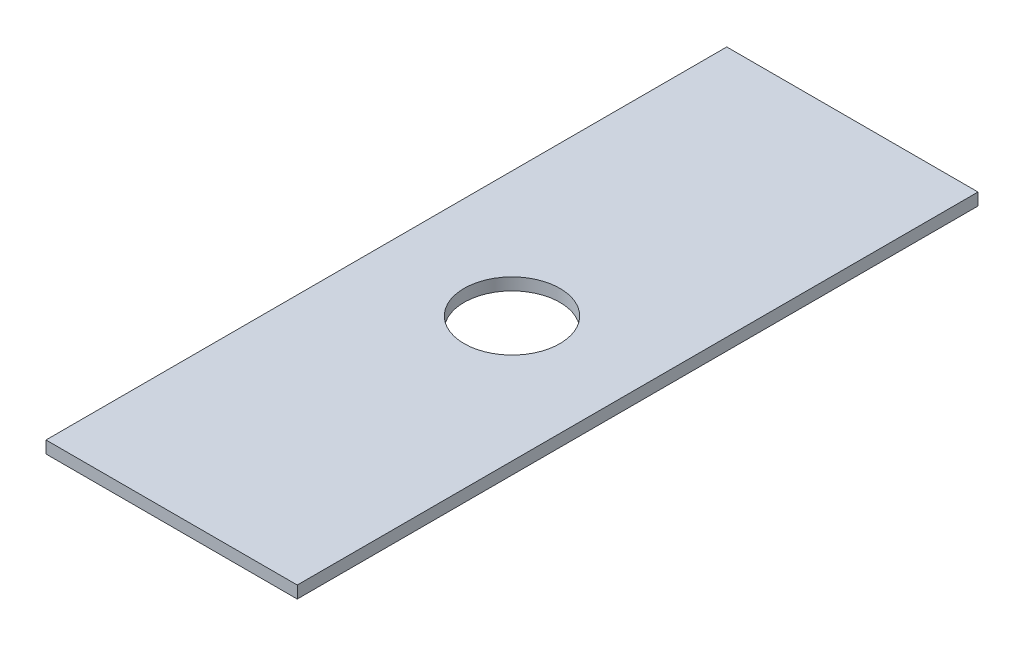
ISO-10303-21;
HEADER;
FILE_DESCRIPTION(('STEP AP214'),'2;1');
FILE_NAME('part.step','',(''),(''),'','','');
FILE_SCHEMA(('AUTOMOTIVE_DESIGN { 1 0 10303 214 1 1 1 1 }'));
ENDSEC;
DATA;
#1=APPLICATION_CONTEXT('core data for automotive mechanical design processes');
#2=APPLICATION_PROTOCOL_DEFINITION('international standard','automotive_design',2000,#1);
#3=PRODUCT_CONTEXT('',#1,'mechanical');
#4=PRODUCT('Part','Part','',(#3));
#5=PRODUCT_RELATED_PRODUCT_CATEGORY('part','',(#4));
#6=PRODUCT_DEFINITION_FORMATION('','',#4);
#7=PRODUCT_DEFINITION_CONTEXT('part definition',#1,'design');
#8=PRODUCT_DEFINITION('design','',#6,#7);
#9=PRODUCT_DEFINITION_SHAPE('','',#8);
#10=(LENGTH_UNIT() NAMED_UNIT(*) SI_UNIT(.MILLI.,.METRE.));
#11=(NAMED_UNIT(*) PLANE_ANGLE_UNIT() SI_UNIT($,.RADIAN.));
#12=(NAMED_UNIT(*) SI_UNIT($,.STERADIAN.) SOLID_ANGLE_UNIT());
#13=UNCERTAINTY_MEASURE_WITH_UNIT(LENGTH_MEASURE(1.E-05),#10,'distance_accuracy_value','');
#14=(GEOMETRIC_REPRESENTATION_CONTEXT(3) GLOBAL_UNCERTAINTY_ASSIGNED_CONTEXT((#13)) GLOBAL_UNIT_ASSIGNED_CONTEXT((#10,
#11,#12)) REPRESENTATION_CONTEXT('',''));
#15=CARTESIAN_POINT('',(0.,0.,0.));
#16=DIRECTION('',(0.,0.,1.));
#17=DIRECTION('',(1.,0.,0.));
#18=AXIS2_PLACEMENT_3D('',#15,#16,#17);
#19=CARTESIAN_POINT('',(-10.4911773591994,-1.016,28.4250297012818));
#20=DIRECTION('',(-1.,0.,0.));
#21=DIRECTION('',(0.,0.,1.));
#22=AXIS2_PLACEMENT_3D('',#19,#20,#21);
#23=PLANE('',#22);
#24=DIRECTION('',(0.,0.,1.));
#25=VECTOR('',#24,1.);
#26=CARTESIAN_POINT('',(-10.4911773591994,0.,28.4250297012818));
#27=LINE('',#26,#25);
#28=CARTESIAN_POINT('',(-10.4911773591994,0.,-28.4250297012818));
#29=VERTEX_POINT('',#28);
#30=CARTESIAN_POINT('',(-10.4911773591994,0.,28.4250297012818));
#31=VERTEX_POINT('',#30);
#32=EDGE_CURVE('E98',#29,#31,#27,.T.);
#33=ORIENTED_EDGE('',*,*,#32,.F.);
#34=DIRECTION('',(0.,1.,0.));
#35=VECTOR('',#34,1.);
#36=CARTESIAN_POINT('',(-10.4911773591994,-1.016,-28.4250297012818));
#37=LINE('',#36,#35);
#38=CARTESIAN_POINT('',(-10.4911773591994,-1.016,-28.4250297012818));
#39=VERTEX_POINT('',#38);
#40=EDGE_CURVE('E11',#39,#29,#37,.T.);
#41=ORIENTED_EDGE('',*,*,#40,.F.);
#42=DIRECTION('',(0.,0.,1.));
#43=VECTOR('',#42,1.);
#44=CARTESIAN_POINT('',(-10.4911773591994,-1.016,28.4250297012818));
#45=LINE('',#44,#43);
#46=CARTESIAN_POINT('',(-10.4911773591994,-1.016,28.4250297012818));
#47=VERTEX_POINT('',#46);
#48=EDGE_CURVE('E91',#39,#47,#45,.T.);
#49=ORIENTED_EDGE('',*,*,#48,.T.);
#50=DIRECTION('',(0.,1.,0.));
#51=VECTOR('',#50,1.);
#52=CARTESIAN_POINT('',(-10.4911773591994,-1.016,28.4250297012818));
#53=LINE('',#52,#51);
#54=EDGE_CURVE('E36',#47,#31,#53,.T.);
#55=ORIENTED_EDGE('',*,*,#54,.T.);
#56=EDGE_LOOP('',(#33,#41,#49,#55));
#57=FACE_BOUND('',#56,.T.);
#58=ADVANCED_FACE('F33',(#57),#23,.T.);
#59=CARTESIAN_POINT('',(-10.4911773591994,-1.016,-28.4250297012818));
#60=DIRECTION('',(0.,0.,-1.));
#61=DIRECTION('',(-1.,0.,0.));
#62=AXIS2_PLACEMENT_3D('',#59,#60,#61);
#63=PLANE('',#62);
#64=DIRECTION('',(-1.,0.,0.));
#65=VECTOR('',#64,1.);
#66=CARTESIAN_POINT('',(-10.4911773591994,0.,-28.4250297012818));
#67=LINE('',#66,#65);
#68=CARTESIAN_POINT('',(10.4911773591994,0.,-28.4250297012818));
#69=VERTEX_POINT('',#68);
#70=EDGE_CURVE('E93',#69,#29,#67,.T.);
#71=ORIENTED_EDGE('',*,*,#70,.F.);
#72=DIRECTION('',(0.,1.,0.));
#73=VECTOR('',#72,1.);
#74=CARTESIAN_POINT('',(10.4911773591994,-1.016,-28.4250297012818));
#75=LINE('',#74,#73);
#76=CARTESIAN_POINT('',(10.4911773591994,-1.016,-28.4250297012818));
#77=VERTEX_POINT('',#76);
#78=EDGE_CURVE('E42',#77,#69,#75,.T.);
#79=ORIENTED_EDGE('',*,*,#78,.F.);
#80=DIRECTION('',(-1.,0.,0.));
#81=VECTOR('',#80,1.);
#82=CARTESIAN_POINT('',(-10.4911773591994,-1.016,-28.4250297012818));
#83=LINE('',#82,#81);
#84=EDGE_CURVE('E88',#77,#39,#83,.T.);
#85=ORIENTED_EDGE('',*,*,#84,.T.);
#86=ORIENTED_EDGE('',*,*,#40,.T.);
#87=EDGE_LOOP('',(#71,#79,#85,#86));
#88=FACE_BOUND('',#87,.T.);
#89=ADVANCED_FACE('F109',(#88),#63,.T.);
#90=CARTESIAN_POINT('',(10.4911773591994,-1.016,28.4250297012818));
#91=DIRECTION('',(1.,0.,0.));
#92=DIRECTION('',(0.,0.,-1.));
#93=AXIS2_PLACEMENT_3D('',#90,#91,#92);
#94=PLANE('',#93);
#95=DIRECTION('',(0.,0.,-1.));
#96=VECTOR('',#95,1.);
#97=CARTESIAN_POINT('',(10.4911773591994,0.,28.4250297012818));
#98=LINE('',#97,#96);
#99=CARTESIAN_POINT('',(10.4911773591994,0.,28.4250297012818));
#100=VERTEX_POINT('',#99);
#101=EDGE_CURVE('E83',#100,#69,#98,.T.);
#102=ORIENTED_EDGE('',*,*,#101,.F.);
#103=DIRECTION('',(0.,1.,0.));
#104=VECTOR('',#103,1.);
#105=CARTESIAN_POINT('',(10.4911773591994,-1.016,28.4250297012818));
#106=LINE('',#105,#104);
#107=CARTESIAN_POINT('',(10.4911773591994,-1.016,28.4250297012818));
#108=VERTEX_POINT('',#107);
#109=EDGE_CURVE('E78',#108,#100,#106,.T.);
#110=ORIENTED_EDGE('',*,*,#109,.F.);
#111=DIRECTION('',(0.,0.,-1.));
#112=VECTOR('',#111,1.);
#113=CARTESIAN_POINT('',(10.4911773591994,-1.016,28.4250297012818));
#114=LINE('',#113,#112);
#115=EDGE_CURVE('E81',#108,#77,#114,.T.);
#116=ORIENTED_EDGE('',*,*,#115,.T.);
#117=ORIENTED_EDGE('',*,*,#78,.T.);
#118=EDGE_LOOP('',(#102,#110,#116,#117));
#119=FACE_BOUND('',#118,.T.);
#120=ADVANCED_FACE('F80',(#119),#94,.T.);
#121=CARTESIAN_POINT('',(-10.4911773591994,-1.016,28.4250297012818));
#122=DIRECTION('',(0.,0.,1.));
#123=DIRECTION('',(1.,0.,0.));
#124=AXIS2_PLACEMENT_3D('',#121,#122,#123);
#125=PLANE('',#124);
#126=DIRECTION('',(1.,0.,0.));
#127=VECTOR('',#126,1.);
#128=CARTESIAN_POINT('',(-10.4911773591994,0.,28.4250297012818));
#129=LINE('',#128,#127);
#130=EDGE_CURVE('E101',#31,#100,#129,.T.);
#131=ORIENTED_EDGE('',*,*,#130,.F.);
#132=ORIENTED_EDGE('',*,*,#54,.F.);
#133=DIRECTION('',(1.,0.,0.));
#134=VECTOR('',#133,1.);
#135=CARTESIAN_POINT('',(-10.4911773591994,-1.016,28.4250297012818));
#136=LINE('',#135,#134);
#137=EDGE_CURVE('E87',#47,#108,#136,.T.);
#138=ORIENTED_EDGE('',*,*,#137,.T.);
#139=ORIENTED_EDGE('',*,*,#109,.T.);
#140=EDGE_LOOP('',(#131,#132,#138,#139));
#141=FACE_BOUND('',#140,.T.);
#142=ADVANCED_FACE('F90',(#141),#125,.T.);
#143=CARTESIAN_POINT('',(-10.4911773591994,-1.016,-28.4250297012818));
#144=DIRECTION('',(0.,-1.,0.));
#145=DIRECTION('',(0.,0.,-1.));
#146=AXIS2_PLACEMENT_3D('',#143,#144,#145);
#147=PLANE('',#146);
#148=CARTESIAN_POINT('',(0.,-1.016,0.));
#149=DIRECTION('',(0.,1.,0.));
#150=DIRECTION('',(0.,0.,1.));
#151=AXIS2_PLACEMENT_3D('',#148,#149,#150);
#152=CIRCLE('',#151,4.);
#153=CARTESIAN_POINT('',(0.,-1.016,4.));
#154=VERTEX_POINT('',#153);
#155=EDGE_CURVE('E102',#154,#154,#152,.T.);
#156=ORIENTED_EDGE('',*,*,#155,.T.);
#157=EDGE_LOOP('',(#156));
#158=FACE_BOUND('',#157,.T.);
#159=ORIENTED_EDGE('',*,*,#48,.F.);
#160=ORIENTED_EDGE('',*,*,#84,.F.);
#161=ORIENTED_EDGE('',*,*,#115,.F.);
#162=ORIENTED_EDGE('',*,*,#137,.F.);
#163=EDGE_LOOP('',(#159,#160,#161,#162));
#164=FACE_BOUND('',#163,.T.);
#165=ADVANCED_FACE('F86',(#158,#164),#147,.T.);
#166=CARTESIAN_POINT('',(-10.4911773591994,0.,-28.4250297012818));
#167=DIRECTION('',(0.,-1.,0.));
#168=DIRECTION('',(0.,0.,-1.));
#169=AXIS2_PLACEMENT_3D('',#166,#167,#168);
#170=PLANE('',#169);
#171=CARTESIAN_POINT('',(0.,0.,0.));
#172=DIRECTION('',(0.,1.,0.));
#173=DIRECTION('',(0.,0.,1.));
#174=AXIS2_PLACEMENT_3D('',#171,#172,#173);
#175=CIRCLE('',#174,4.);
#176=CARTESIAN_POINT('',(0.,0.,4.));
#177=VERTEX_POINT('',#176);
#178=EDGE_CURVE('E139',#177,#177,#175,.T.);
#179=ORIENTED_EDGE('',*,*,#178,.F.);
#180=EDGE_LOOP('',(#179));
#181=FACE_BOUND('',#180,.T.);
#182=ORIENTED_EDGE('',*,*,#32,.T.);
#183=ORIENTED_EDGE('',*,*,#130,.T.);
#184=ORIENTED_EDGE('',*,*,#101,.T.);
#185=ORIENTED_EDGE('',*,*,#70,.T.);
#186=EDGE_LOOP('',(#182,#183,#184,#185));
#187=FACE_BOUND('',#186,.T.);
#188=ADVANCED_FACE('F108',(#181,#187),#170,.F.);
#189=CARTESIAN_POINT('',(0.,-1.016,0.));
#190=DIRECTION('',(0.,1.,0.));
#191=DIRECTION('',(0.,0.,1.));
#192=AXIS2_PLACEMENT_3D('',#189,#190,#191);
#193=CYLINDRICAL_SURFACE('',#192,4.);
#194=ORIENTED_EDGE('',*,*,#155,.F.);
#195=EDGE_LOOP('',(#194));
#196=FACE_BOUND('',#195,.T.);
#197=ORIENTED_EDGE('',*,*,#178,.T.);
#198=EDGE_LOOP('',(#197));
#199=FACE_BOUND('',#198,.T.);
#200=ADVANCED_FACE('F127',(#196,#199),#193,.F.);
#201=CLOSED_SHELL('',(#58,#89,#120,#142,#165,#188,#200));
#202=MANIFOLD_SOLID_BREP('B2',#201);
#203=ADVANCED_BREP_SHAPE_REPRESENTATION('',(#18,#202),#14);
#204=SHAPE_DEFINITION_REPRESENTATION(#9,#203);
ENDSEC;
END-ISO-10303-21;
